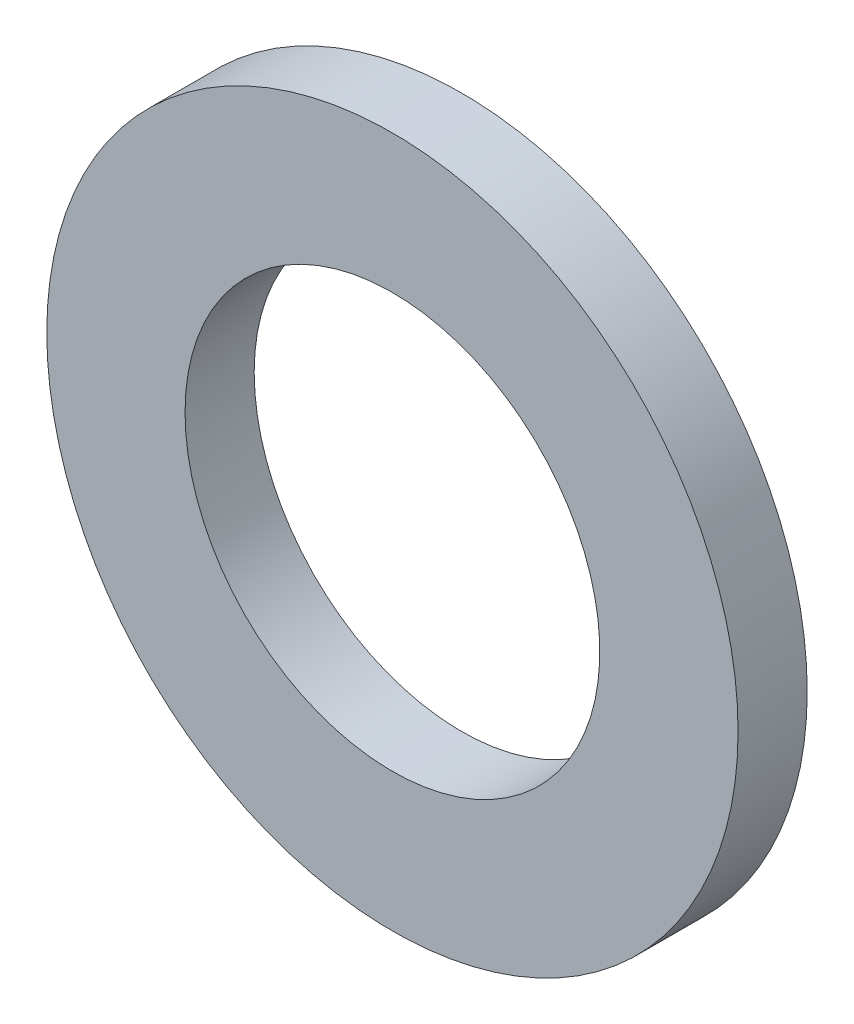
ISO-10303-21;
HEADER;
FILE_DESCRIPTION(('STEP AP214'),'2;1');
FILE_NAME('part.step','',(''),(''),'','','');
FILE_SCHEMA(('AUTOMOTIVE_DESIGN { 1 0 10303 214 1 1 1 1 }'));
ENDSEC;
DATA;
#1=APPLICATION_CONTEXT('core data for automotive mechanical design processes');
#2=APPLICATION_PROTOCOL_DEFINITION('international standard','automotive_design',2000,#1);
#3=PRODUCT_CONTEXT('',#1,'mechanical');
#4=PRODUCT('Part','Part','',(#3));
#5=PRODUCT_RELATED_PRODUCT_CATEGORY('part','',(#4));
#6=PRODUCT_DEFINITION_FORMATION('','',#4);
#7=PRODUCT_DEFINITION_CONTEXT('part definition',#1,'design');
#8=PRODUCT_DEFINITION('design','',#6,#7);
#9=PRODUCT_DEFINITION_SHAPE('','',#8);
#10=(LENGTH_UNIT() NAMED_UNIT(*) SI_UNIT(.MILLI.,.METRE.));
#11=(NAMED_UNIT(*) PLANE_ANGLE_UNIT() SI_UNIT($,.RADIAN.));
#12=(NAMED_UNIT(*) SI_UNIT($,.STERADIAN.) SOLID_ANGLE_UNIT());
#13=UNCERTAINTY_MEASURE_WITH_UNIT(LENGTH_MEASURE(1.E-05),#10,'distance_accuracy_value','');
#14=(GEOMETRIC_REPRESENTATION_CONTEXT(3) GLOBAL_UNCERTAINTY_ASSIGNED_CONTEXT((#13)) GLOBAL_UNIT_ASSIGNED_CONTEXT((#10,
#11,#12)) REPRESENTATION_CONTEXT('',''));
#15=CARTESIAN_POINT('',(0.,0.,0.));
#16=DIRECTION('',(0.,0.,1.));
#17=DIRECTION('',(1.,0.,0.));
#18=AXIS2_PLACEMENT_3D('',#15,#16,#17);
#19=CARTESIAN_POINT('',(3.,0.,0.));
#20=DIRECTION('',(0.,0.,-1.));
#21=DIRECTION('',(-1.,0.,0.));
#22=AXIS2_PLACEMENT_3D('',#19,#20,#21);
#23=PLANE('',#22);
#24=CARTESIAN_POINT('',(0.,0.,0.));
#25=DIRECTION('',(0.,0.,-1.));
#26=DIRECTION('',(-1.,0.,0.));
#27=AXIS2_PLACEMENT_3D('',#24,#25,#26);
#28=CIRCLE('',#27,3.);
#29=CARTESIAN_POINT('',(-3.,0.,0.));
#30=VERTEX_POINT('',#29);
#31=EDGE_CURVE('E17',#30,#30,#28,.T.);
#32=ORIENTED_EDGE('',*,*,#31,.T.);
#33=EDGE_LOOP('',(#32));
#34=FACE_BOUND('',#33,.T.);
#35=CARTESIAN_POINT('',(0.,0.,0.));
#36=DIRECTION('',(0.,0.,-1.));
#37=DIRECTION('',(-1.,0.,0.));
#38=AXIS2_PLACEMENT_3D('',#35,#36,#37);
#39=CIRCLE('',#38,5.00000000000001);
#40=CARTESIAN_POINT('',(-5.00000000000001,0.,0.));
#41=VERTEX_POINT('',#40);
#42=EDGE_CURVE('E31',#41,#41,#39,.T.);
#43=ORIENTED_EDGE('',*,*,#42,.F.);
#44=EDGE_LOOP('',(#43));
#45=FACE_BOUND('',#44,.T.);
#46=ADVANCED_FACE('F14',(#34,#45),#23,.F.);
#47=CARTESIAN_POINT('',(0.,0.,-50.5666886351557));
#48=DIRECTION('',(0.,0.,-1.));
#49=DIRECTION('',(-1.,0.,0.));
#50=AXIS2_PLACEMENT_3D('',#47,#48,#49);
#51=CYLINDRICAL_SURFACE('',#50,3.);
#52=ORIENTED_EDGE('',*,*,#31,.F.);
#53=EDGE_LOOP('',(#52));
#54=FACE_BOUND('',#53,.T.);
#55=CARTESIAN_POINT('',(0.,0.,-0.999999999999994));
#56=DIRECTION('',(0.,0.,-1.));
#57=DIRECTION('',(-1.,0.,0.));
#58=AXIS2_PLACEMENT_3D('',#55,#56,#57);
#59=CIRCLE('',#58,3.);
#60=CARTESIAN_POINT('',(-3.,0.,-0.999999999999994));
#61=VERTEX_POINT('',#60);
#62=EDGE_CURVE('E22',#61,#61,#59,.T.);
#63=ORIENTED_EDGE('',*,*,#62,.T.);
#64=EDGE_LOOP('',(#63));
#65=FACE_BOUND('',#64,.T.);
#66=ADVANCED_FACE('F45',(#54,#65),#51,.F.);
#67=CARTESIAN_POINT('',(0.,0.,-50.5666886351557));
#68=DIRECTION('',(0.,0.,-1.));
#69=DIRECTION('',(-1.,0.,0.));
#70=AXIS2_PLACEMENT_3D('',#67,#68,#69);
#71=CYLINDRICAL_SURFACE('',#70,5.00000000000001);
#72=CARTESIAN_POINT('',(0.,0.,-0.999999999999994));
#73=DIRECTION('',(0.,0.,-1.));
#74=DIRECTION('',(-1.,0.,0.));
#75=AXIS2_PLACEMENT_3D('',#72,#73,#74);
#76=CIRCLE('',#75,5.00000000000001);
#77=CARTESIAN_POINT('',(-5.00000000000001,0.,-0.999999999999994));
#78=VERTEX_POINT('',#77);
#79=EDGE_CURVE('E10',#78,#78,#76,.F.);
#80=ORIENTED_EDGE('',*,*,#79,.T.);
#81=EDGE_LOOP('',(#80));
#82=FACE_BOUND('',#81,.T.);
#83=ORIENTED_EDGE('',*,*,#42,.T.);
#84=EDGE_LOOP('',(#83));
#85=FACE_BOUND('',#84,.T.);
#86=ADVANCED_FACE('F48',(#82,#85),#71,.T.);
#87=CARTESIAN_POINT('',(3.00000000000001,0.,-0.999999999999992));
#88=DIRECTION('',(0.,0.,1.));
#89=DIRECTION('',(1.,0.,0.));
#90=AXIS2_PLACEMENT_3D('',#87,#88,#89);
#91=PLANE('',#90);
#92=ORIENTED_EDGE('',*,*,#79,.F.);
#93=EDGE_LOOP('',(#92));
#94=FACE_BOUND('',#93,.T.);
#95=ORIENTED_EDGE('',*,*,#62,.F.);
#96=EDGE_LOOP('',(#95));
#97=FACE_BOUND('',#96,.T.);
#98=ADVANCED_FACE('F51',(#94,#97),#91,.F.);
#99=CLOSED_SHELL('',(#46,#66,#86,#98));
#100=MANIFOLD_SOLID_BREP('B1',#99);
#101=ADVANCED_BREP_SHAPE_REPRESENTATION('',(#18,#100),#14);
#102=SHAPE_DEFINITION_REPRESENTATION(#9,#101);
ENDSEC;
END-ISO-10303-21;
